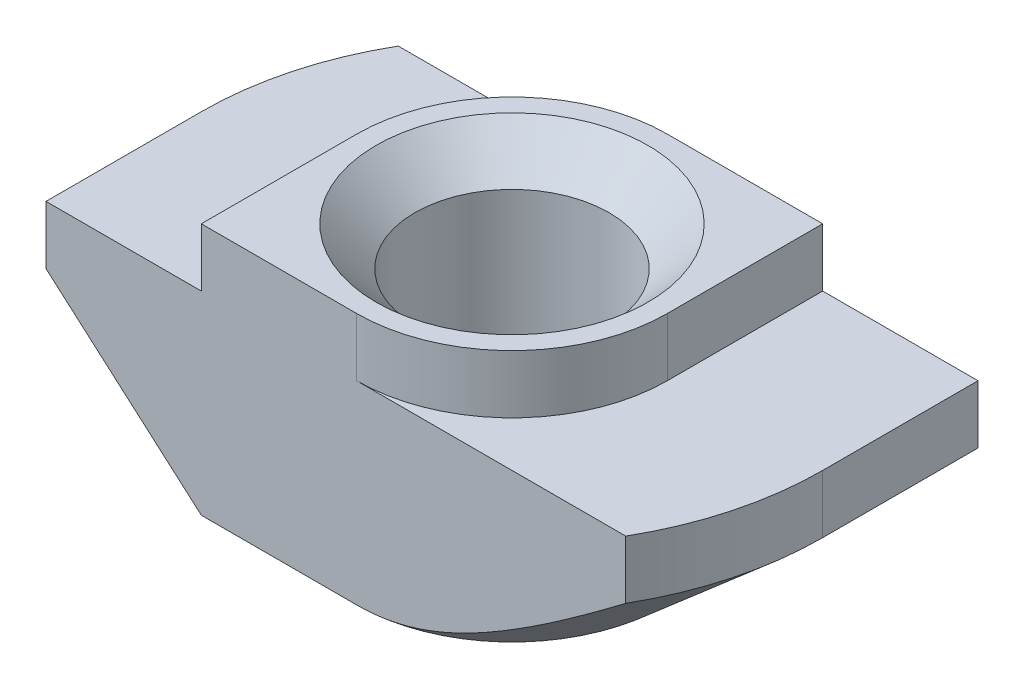
ISO-10303-21;
HEADER;
FILE_DESCRIPTION(('STEP AP214'),'2;1');
FILE_NAME('part.step','',(''),(''),'','','');
FILE_SCHEMA(('AUTOMOTIVE_DESIGN { 1 0 10303 214 1 1 1 1 }'));
ENDSEC;
DATA;
#1=APPLICATION_CONTEXT('core data for automotive mechanical design processes');
#2=APPLICATION_PROTOCOL_DEFINITION('international standard','automotive_design',2000,#1);
#3=PRODUCT_CONTEXT('',#1,'mechanical');
#4=PRODUCT('Part','Part','',(#3));
#5=PRODUCT_RELATED_PRODUCT_CATEGORY('part','',(#4));
#6=PRODUCT_DEFINITION_FORMATION('','',#4);
#7=PRODUCT_DEFINITION_CONTEXT('part definition',#1,'design');
#8=PRODUCT_DEFINITION('design','',#6,#7);
#9=PRODUCT_DEFINITION_SHAPE('','',#8);
#10=(LENGTH_UNIT() NAMED_UNIT(*) SI_UNIT(.MILLI.,.METRE.));
#11=(NAMED_UNIT(*) PLANE_ANGLE_UNIT() SI_UNIT($,.RADIAN.));
#12=(NAMED_UNIT(*) SI_UNIT($,.STERADIAN.) SOLID_ANGLE_UNIT());
#13=UNCERTAINTY_MEASURE_WITH_UNIT(LENGTH_MEASURE(1.E-05),#10,'distance_accuracy_value','');
#14=(GEOMETRIC_REPRESENTATION_CONTEXT(3) GLOBAL_UNCERTAINTY_ASSIGNED_CONTEXT((#13)) GLOBAL_UNIT_ASSIGNED_CONTEXT((#10,
#11,#12)) REPRESENTATION_CONTEXT('',''));
#15=CARTESIAN_POINT('',(0.,0.,0.));
#16=DIRECTION('',(0.,0.,1.));
#17=DIRECTION('',(1.,0.,0.));
#18=AXIS2_PLACEMENT_3D('',#15,#16,#17);
#19=CARTESIAN_POINT('',(-8.,-1.5,4.));
#20=DIRECTION('',(1.,0.,0.));
#21=DIRECTION('',(0.,0.,-1.));
#22=AXIS2_PLACEMENT_3D('',#19,#20,#21);
#23=PLANE('',#22);
#24=DIRECTION('',(0.,0.,-1.));
#25=VECTOR('',#24,1.);
#26=CARTESIAN_POINT('',(-8.,-3.,4.));
#27=LINE('',#26,#25);
#28=CARTESIAN_POINT('',(-8.,-3.,4.));
#29=VERTEX_POINT('',#28);
#30=CARTESIAN_POINT('',(-8.,-3.,0.));
#31=VERTEX_POINT('',#30);
#32=EDGE_CURVE('E316',#29,#31,#27,.T.);
#33=ORIENTED_EDGE('',*,*,#32,.F.);
#34=DIRECTION('',(0.,-1.,0.));
#35=VECTOR('',#34,1.);
#36=CARTESIAN_POINT('',(-8.,-1.5,4.));
#37=LINE('',#36,#35);
#38=CARTESIAN_POINT('',(-8.,-1.5,4.));
#39=VERTEX_POINT('',#38);
#40=EDGE_CURVE('E163',#39,#29,#37,.T.);
#41=ORIENTED_EDGE('',*,*,#40,.F.);
#42=DIRECTION('',(0.,0.,-1.));
#43=VECTOR('',#42,1.);
#44=CARTESIAN_POINT('',(-8.,-1.5,4.));
#45=LINE('',#44,#43);
#46=CARTESIAN_POINT('',(-8.,-1.5,0.));
#47=VERTEX_POINT('',#46);
#48=EDGE_CURVE('E45',#39,#47,#45,.T.);
#49=ORIENTED_EDGE('',*,*,#48,.T.);
#50=DIRECTION('',(0.,1.,0.));
#51=VECTOR('',#50,1.);
#52=CARTESIAN_POINT('',(-8.,-6.5,0.));
#53=LINE('',#52,#51);
#54=EDGE_CURVE('E209',#31,#47,#53,.T.);
#55=ORIENTED_EDGE('',*,*,#54,.F.);
#56=EDGE_LOOP('',(#33,#41,#49,#55));
#57=FACE_BOUND('',#56,.T.);
#58=ADVANCED_FACE('F37',(#57),#23,.F.);
#59=CARTESIAN_POINT('',(-8.,-6.5,4.));
#60=DIRECTION('',(0.,1.,0.));
#61=DIRECTION('',(0.,0.,1.));
#62=AXIS2_PLACEMENT_3D('',#59,#60,#61);
#63=PLANE('',#62);
#64=CARTESIAN_POINT('',(0.,-6.5,0.));
#65=DIRECTION('',(0.,1.,0.));
#66=DIRECTION('',(0.,0.,1.));
#67=AXIS2_PLACEMENT_3D('',#64,#65,#66);
#68=CIRCLE('',#67,3.5);
#69=CARTESIAN_POINT('',(0.,-6.5,3.5));
#70=VERTEX_POINT('',#69);
#71=EDGE_CURVE('E258',#70,#70,#68,.T.);
#72=ORIENTED_EDGE('',*,*,#71,.T.);
#73=EDGE_LOOP('',(#72));
#74=FACE_BOUND('',#73,.T.);
#75=DIRECTION('',(1.,0.,0.));
#76=VECTOR('',#75,1.);
#77=CARTESIAN_POINT('',(-8.,-6.5,4.));
#78=LINE('',#77,#76);
#79=CARTESIAN_POINT('',(-4.,-6.5,4.));
#80=VERTEX_POINT('',#79);
#81=CARTESIAN_POINT('',(0.,-6.5,4.));
#82=VERTEX_POINT('',#81);
#83=EDGE_CURVE('E161',#80,#82,#78,.T.);
#84=ORIENTED_EDGE('',*,*,#83,.F.);
#85=DIRECTION('',(0.,0.,-1.));
#86=VECTOR('',#85,1.);
#87=CARTESIAN_POINT('',(-4.,-6.5,4.));
#88=LINE('',#87,#86);
#89=CARTESIAN_POINT('',(-4.,-6.5,0.));
#90=VERTEX_POINT('',#89);
#91=EDGE_CURVE('E146',#80,#90,#88,.T.);
#92=ORIENTED_EDGE('',*,*,#91,.T.);
#93=CARTESIAN_POINT('',(0.,-6.5,0.));
#94=DIRECTION('',(0.,-1.,0.));
#95=DIRECTION('',(-1.,0.,0.));
#96=AXIS2_PLACEMENT_3D('',#93,#94,#95);
#97=CIRCLE('',#96,4.);
#98=CARTESIAN_POINT('',(0.,-6.5,-4.));
#99=VERTEX_POINT('',#98);
#100=EDGE_CURVE('E317',#90,#99,#97,.T.);
#101=ORIENTED_EDGE('',*,*,#100,.T.);
#102=DIRECTION('',(1.,0.,0.));
#103=VECTOR('',#102,1.);
#104=CARTESIAN_POINT('',(-8.,-6.5,-4.));
#105=LINE('',#104,#103);
#106=CARTESIAN_POINT('',(4.,-6.5,-4.));
#107=VERTEX_POINT('',#106);
#108=EDGE_CURVE('E181',#99,#107,#105,.T.);
#109=ORIENTED_EDGE('',*,*,#108,.T.);
#110=DIRECTION('',(0.,0.,1.));
#111=VECTOR('',#110,1.);
#112=CARTESIAN_POINT('',(4.,-6.5,-8.));
#113=LINE('',#112,#111);
#114=CARTESIAN_POINT('',(4.,-6.5,0.));
#115=VERTEX_POINT('',#114);
#116=EDGE_CURVE('E52',#107,#115,#113,.T.);
#117=ORIENTED_EDGE('',*,*,#116,.T.);
#118=CARTESIAN_POINT('',(0.,-6.5,0.));
#119=DIRECTION('',(0.,-1.,0.));
#120=DIRECTION('',(1.,0.,0.));
#121=AXIS2_PLACEMENT_3D('',#118,#119,#120);
#122=CIRCLE('',#121,4.);
#123=EDGE_CURVE('E167',#115,#82,#122,.T.);
#124=ORIENTED_EDGE('',*,*,#123,.T.);
#125=EDGE_LOOP('',(#84,#92,#101,#109,#117,#124));
#126=FACE_BOUND('',#125,.T.);
#127=ADVANCED_FACE('F166',(#74,#126),#63,.F.);
#128=CARTESIAN_POINT('',(8.,-1.5,4.));
#129=DIRECTION('',(-1.,0.,0.));
#130=DIRECTION('',(0.,0.,1.));
#131=AXIS2_PLACEMENT_3D('',#128,#129,#130);
#132=PLANE('',#131);
#133=DIRECTION('',(0.,0.,1.));
#134=VECTOR('',#133,1.);
#135=CARTESIAN_POINT('',(8.,-3.,-8.));
#136=LINE('',#135,#134);
#137=CARTESIAN_POINT('',(8.,-3.,-4.));
#138=VERTEX_POINT('',#137);
#139=CARTESIAN_POINT('',(8.,-3.,0.));
#140=VERTEX_POINT('',#139);
#141=EDGE_CURVE('E304',#138,#140,#136,.T.);
#142=ORIENTED_EDGE('',*,*,#141,.F.);
#143=DIRECTION('',(0.,1.,0.));
#144=VECTOR('',#143,1.);
#145=CARTESIAN_POINT('',(8.,-1.5,-4.));
#146=LINE('',#145,#144);
#147=CARTESIAN_POINT('',(8.,-1.5,-4.));
#148=VERTEX_POINT('',#147);
#149=EDGE_CURVE('E185',#138,#148,#146,.T.);
#150=ORIENTED_EDGE('',*,*,#149,.T.);
#151=DIRECTION('',(0.,0.,-1.));
#152=VECTOR('',#151,1.);
#153=CARTESIAN_POINT('',(8.,-1.5,4.));
#154=LINE('',#153,#152);
#155=CARTESIAN_POINT('',(8.,-1.5,0.));
#156=VERTEX_POINT('',#155);
#157=EDGE_CURVE('E203',#156,#148,#154,.T.);
#158=ORIENTED_EDGE('',*,*,#157,.F.);
#159=DIRECTION('',(0.,1.,0.));
#160=VECTOR('',#159,1.);
#161=CARTESIAN_POINT('',(8.,-6.5,0.));
#162=LINE('',#161,#160);
#163=EDGE_CURVE('E220',#140,#156,#162,.T.);
#164=ORIENTED_EDGE('',*,*,#163,.F.);
#165=EDGE_LOOP('',(#142,#150,#158,#164));
#166=FACE_BOUND('',#165,.T.);
#167=ADVANCED_FACE('F303',(#166),#132,.F.);
#168=CARTESIAN_POINT('',(0.,0.,4.));
#169=DIRECTION('',(0.,0.,-1.));
#170=DIRECTION('',(-1.,0.,0.));
#171=AXIS2_PLACEMENT_3D('',#168,#169,#170);
#172=PLANE('',#171);
#173=DIRECTION('',(-0.752576694706878,0.658504607868518,0.));
#174=VECTOR('',#173,1.);
#175=CARTESIAN_POINT('',(-4.,-6.5,4.));
#176=LINE('',#175,#174);
#177=EDGE_CURVE('E149',#80,#29,#176,.T.);
#178=ORIENTED_EDGE('',*,*,#177,.F.);
#179=ORIENTED_EDGE('',*,*,#83,.T.);
#180=CARTESIAN_POINT('',(14.6904905784055,3.32215914737832,4.));
#181=CARTESIAN_POINT('',(14.3847340887088,3.06403182750837,4.));
#182=CARTESIAN_POINT('',(14.0787139356754,2.80621594721695,4.));
#183=CARTESIAN_POINT('',(13.4660102927614,2.29136853816874,4.));
#184=CARTESIAN_POINT('',(13.1593267973511,2.03433701599371,4.));
#185=CARTESIAN_POINT('',(12.5450720332835,1.52114597216813,4.));
#186=CARTESIAN_POINT('',(12.2375005226594,1.26498673998448,4.));
#187=CARTESIAN_POINT('',(11.621379785589,0.753848346635908,4.));
#188=CARTESIAN_POINT('',(11.3128305625947,0.498869181312189,4.));
#189=CARTESIAN_POINT('',(10.7002145011881,-0.00491682645367106,4.));
#190=CARTESIAN_POINT('',(10.3961699625989,-0.253750767290044,4.));
#191=CARTESIAN_POINT('',(9.78659827767615,-0.749595514973884,4.));
#192=CARTESIAN_POINT('',(9.48107113722175,-0.996606329041067,4.));
#193=CARTESIAN_POINT('',(8.86814910234505,-1.48822154847088,4.));
#194=CARTESIAN_POINT('',(8.56075445261905,-1.7328262585509,4.));
#195=CARTESIAN_POINT('',(7.94347197423434,-2.21886531838598,4.));
#196=CARTESIAN_POINT('',(7.63358419509566,-2.46029973086189,4.));
#197=CARTESIAN_POINT('',(7.08115132126321,-2.88450105938665,4.));
#198=CARTESIAN_POINT('',(6.83928285358191,-3.06814795081988,4.));
#199=CARTESIAN_POINT('',(6.35294664237881,-3.43201927580775,4.));
#200=CARTESIAN_POINT('',(6.10847869152532,-3.61224343312641,4.));
#201=CARTESIAN_POINT('',(5.61348157153568,-3.97001904061898,4.));
#202=CARTESIAN_POINT('',(5.36291531280204,-4.14751931475903,4.));
#203=CARTESIAN_POINT('',(4.85727365006101,-4.49592911962344,4.));
#204=CARTESIAN_POINT('',(4.60219916319015,-4.66683996887094,4.));
#205=CARTESIAN_POINT('',(4.2130071322017,-4.91734041501033,4.));
#206=CARTESIAN_POINT('',(4.08116535064602,-5.00046374434322,4.));
#207=CARTESIAN_POINT('',(3.81562875478638,-5.16368942812443,4.));
#208=CARTESIAN_POINT('',(3.68193405117562,-5.24379196197976,4.));
#209=CARTESIAN_POINT('',(3.41220147814096,-5.40038499680941,4.));
#210=CARTESIAN_POINT('',(3.27616075326498,-5.47687059912128,4.));
#211=CARTESIAN_POINT('',(3.00156225820197,-5.62520082854102,4.));
#212=CARTESIAN_POINT('',(2.86300454546661,-5.69704556140923,4.));
#213=CARTESIAN_POINT('',(2.5849954677744,-5.83393518990307,4.));
#214=CARTESIAN_POINT('',(2.44558485527697,-5.89906227835382,4.));
#215=CARTESIAN_POINT('',(2.16361562976938,-6.02223140662004,4.));
#216=CARTESIAN_POINT('',(2.02105656760955,-6.08027242774449,4.));
#217=CARTESIAN_POINT('',(1.7329549007792,-6.18735094349871,4.));
#218=CARTESIAN_POINT('',(1.58742049089665,-6.2364102179662,4.));
#219=CARTESIAN_POINT('',(1.29316207972955,-6.32363216278026,4.));
#220=CARTESIAN_POINT('',(1.1444398948231,-6.36180086992272,4.));
#221=CARTESIAN_POINT('',(0.839100640998917,-6.42624492204711,4.));
#222=CARTESIAN_POINT('',(0.682386957719906,-6.45207249805466,4.));
#223=CARTESIAN_POINT('',(0.367144369417336,-6.48794533602483,4.));
#224=CARTESIAN_POINT('',(0.208615728897641,-6.49799286893765,4.));
#225=CARTESIAN_POINT('',(-0.108539722018433,-6.50145944673209,4.));
#226=CARTESIAN_POINT('',(-0.267166425139258,-6.49488795542754,4.));
#227=CARTESIAN_POINT('',(-0.582932728201337,-6.46570204746688,4.));
#228=CARTESIAN_POINT('',(-0.740071943547874,-6.44308359075197,4.));
#229=CARTESIAN_POINT('',(-1.09152696533888,-6.37587755691426,4.));
#230=CARTESIAN_POINT('',(-1.28504118066978,-6.32714329543957,4.));
#231=CARTESIAN_POINT('',(-1.66656634751073,-6.21161586114347,4.));
#232=CARTESIAN_POINT('',(-1.85457361936942,-6.14481090567952,4.));
#233=CARTESIAN_POINT('',(-2.22785278502951,-5.99643229439673,4.));
#234=CARTESIAN_POINT('',(-2.41304095011,-5.91465153583585,4.));
#235=CARTESIAN_POINT('',(-2.77832077795005,-5.74066303773618,4.));
#236=CARTESIAN_POINT('',(-2.95841376958414,-5.64845804888058,4.));
#237=CARTESIAN_POINT('',(-3.34961919306917,-5.43725005686976,4.));
#238=CARTESIAN_POINT('',(-3.55981165080308,-5.31655620274668,4.));
#239=CARTESIAN_POINT('',(-3.97543991863338,-5.06719713259556,4.));
#240=CARTESIAN_POINT('',(-4.18087442666426,-4.93852976912504,4.));
#241=CARTESIAN_POINT('',(-4.5882400284195,-4.67520296890076,4.));
#242=CARTESIAN_POINT('',(-4.79016601988849,-4.54053567979022,4.));
#243=CARTESIAN_POINT('',(-5.19103912814155,-4.26683396442206,4.));
#244=CARTESIAN_POINT('',(-5.38998608598997,-4.12779930637635,4.));
#245=CARTESIAN_POINT('',(-5.7725203673202,-3.8556281179886,4.));
#246=CARTESIAN_POINT('',(-5.95625882060498,-3.72270335637143,4.));
#247=CARTESIAN_POINT('',(-6.32204531106766,-3.45453802790882,4.));
#248=CARTESIAN_POINT('',(-6.50409328688208,-3.31929737750067,4.));
#249=CARTESIAN_POINT('',(-6.86616256077309,-3.04743487184612,4.));
#250=CARTESIAN_POINT('',(-7.04618870734579,-2.91081946202426,4.));
#251=CARTESIAN_POINT('',(-7.4050622812191,-2.63608068651936,4.));
#252=CARTESIAN_POINT('',(-7.58390981061062,-2.49795745427084,4.));
#253=CARTESIAN_POINT('',(-7.76228734813001,-2.35923541653878,4.));
#254=B_SPLINE_CURVE_WITH_KNOTS('',3,(#180,#181,#182,#183,#184,#185,#186,#187,#188,#189,#190,
#191,#192,#193,#194,#195,#196,#197,#198,#199,#200,#201,#202,#203,#204,#205,#206,#207,#208,#209,
#210,#211,#212,#213,#214,#215,#216,#217,#218,#219,#220,#221,#222,#223,#224,#225,#226,#227,#228,
#229,#230,#231,#232,#233,#234,#235,#236,#237,#238,#239,#240,#241,#242,#243,#244,#245,#246,#247,
#248,#249,#250,#251,#252,#253),.UNSPECIFIED.,.F.,.F.,(4,2,2,2,2,2,2,2,2,2,2,2,2,2,2,2,2,2,2,2,2,
2,2,2,2,2,2,2,2,2,2,2,2,2,2,2,4),(0.,1.20043834755379,2.40088674077275,3.60170079974658,
4.8025106235708,5.98117091859529,7.15982654353094,8.33833092623221,9.51681195828205,
10.4278547957749,11.3389708502966,12.2601049438173,13.1810537544666,13.6485968730272,
14.1161121800276,14.5842435321965,15.052364212398,15.5138255838833,15.975353217003,
16.4357464236847,16.8958839298801,17.3716429767656,17.8473335495587,18.3227532981969,
18.798292783222,19.3957954910143,19.9936887317903,20.6005786392438,21.2073087763798,
21.9341934237486,22.6612746952789,23.3893372114805,24.1174384334345,24.7977544137816,
25.4780949934672,26.1560676910982,26.8339808703156),.UNSPECIFIED.);
#255=CARTESIAN_POINT('',(6.92820323027551,-3.,4.));
#256=VERTEX_POINT('',#255);
#257=EDGE_CURVE('E321',#256,#82,#254,.T.);
#258=ORIENTED_EDGE('',*,*,#257,.F.);
#259=DIRECTION('',(0.,1.,0.));
#260=VECTOR('',#259,1.);
#261=CARTESIAN_POINT('',(6.92820323027551,-6.5,4.));
#262=LINE('',#261,#260);
#263=CARTESIAN_POINT('',(6.92820323027551,-1.5,4.));
#264=VERTEX_POINT('',#263);
#265=EDGE_CURVE('E223',#256,#264,#262,.T.);
#266=ORIENTED_EDGE('',*,*,#265,.T.);
#267=DIRECTION('',(-1.,0.,0.));
#268=VECTOR('',#267,1.);
#269=CARTESIAN_POINT('',(4.,-1.5,4.));
#270=LINE('',#269,#268);
#271=CARTESIAN_POINT('',(0.,-1.5,4.));
#272=VERTEX_POINT('',#271);
#273=EDGE_CURVE('E168',#264,#272,#270,.T.);
#274=ORIENTED_EDGE('',*,*,#273,.T.);
#275=DIRECTION('',(0.,1.,0.));
#276=VECTOR('',#275,1.);
#277=CARTESIAN_POINT('',(0.,-7.15685424949238,4.));
#278=LINE('',#277,#276);
#279=CARTESIAN_POINT('',(0.,0.,4.));
#280=VERTEX_POINT('',#279);
#281=EDGE_CURVE('E246',#272,#280,#278,.T.);
#282=ORIENTED_EDGE('',*,*,#281,.T.);
#283=DIRECTION('',(-1.,0.,0.));
#284=VECTOR('',#283,1.);
#285=CARTESIAN_POINT('',(4.,0.,4.));
#286=LINE('',#285,#284);
#287=CARTESIAN_POINT('',(-4.,0.,4.));
#288=VERTEX_POINT('',#287);
#289=EDGE_CURVE('E170',#280,#288,#286,.T.);
#290=ORIENTED_EDGE('',*,*,#289,.T.);
#291=DIRECTION('',(0.,-1.,0.));
#292=VECTOR('',#291,1.);
#293=CARTESIAN_POINT('',(-4.,0.,4.));
#294=LINE('',#293,#292);
#295=CARTESIAN_POINT('',(-4.,-1.5,4.));
#296=VERTEX_POINT('',#295);
#297=EDGE_CURVE('E196',#288,#296,#294,.T.);
#298=ORIENTED_EDGE('',*,*,#297,.T.);
#299=DIRECTION('',(-1.,0.,0.));
#300=VECTOR('',#299,1.);
#301=CARTESIAN_POINT('',(-4.,-1.5,4.));
#302=LINE('',#301,#300);
#303=EDGE_CURVE('E172',#296,#39,#302,.T.);
#304=ORIENTED_EDGE('',*,*,#303,.T.);
#305=ORIENTED_EDGE('',*,*,#40,.T.);
#306=EDGE_LOOP('',(#178,#179,#258,#266,#274,#282,#290,#298,#304,#305));
#307=FACE_BOUND('',#306,.T.);
#308=ADVANCED_FACE('F159',(#307),#172,.F.);
#309=CARTESIAN_POINT('',(0.,0.,-4.));
#310=DIRECTION('',(0.,0.,-1.));
#311=DIRECTION('',(-1.,0.,0.));
#312=AXIS2_PLACEMENT_3D('',#309,#310,#311);
#313=PLANE('',#312);
#314=ORIENTED_EDGE('',*,*,#108,.F.);
#315=CARTESIAN_POINT('',(7.76228734813001,-2.35923541653878,-4.));
#316=CARTESIAN_POINT('',(7.63797879352638,-2.45592015293055,-4.));
#317=CARTESIAN_POINT('',(7.51343705696513,-2.55230486304676,-4.));
#318=CARTESIAN_POINT('',(7.26381762684636,-2.74438155235194,-4.));
#319=CARTESIAN_POINT('',(7.13873992508832,-2.84007352088096,-4.));
#320=CARTESIAN_POINT('',(6.76245796143779,-3.12607801429787,-4.));
#321=CARTESIAN_POINT('',(6.51034969039623,-3.3152061228012,-4.));
#322=CARTESIAN_POINT('',(5.99410259404109,-3.69579382335301,-4.));
#323=CARTESIAN_POINT('',(5.72985208763481,-3.88710225926351,-4.));
#324=CARTESIAN_POINT('',(5.19695761667315,-4.26334385378289,-4.));
#325=CARTESIAN_POINT('',(4.92831530480901,-4.44827933273934,-4.));
#326=CARTESIAN_POINT('',(4.52051944159743,-4.71893396527764,-4.));
#327=CARTESIAN_POINT('',(4.38365763859022,-4.80810405751299,-4.));
#328=CARTESIAN_POINT('',(4.10812140998681,-4.98359259792687,-4.));
#329=CARTESIAN_POINT('',(3.96944707174393,-5.06991118282885,-4.));
#330=CARTESIAN_POINT('',(3.68976495223787,-5.23915159478084,-4.));
#331=CARTESIAN_POINT('',(3.5487541633338,-5.32206847356048,-4.));
#332=CARTESIAN_POINT('',(3.26422692934428,-5.48348784331378,-4.));
#333=CARTESIAN_POINT('',(3.12071056146737,-5.56199046999753,-4.));
#334=CARTESIAN_POINT('',(2.83282374140378,-5.71234353123719,-4.));
#335=CARTESIAN_POINT('',(2.68849544072785,-5.78427356099484,-4.));
#336=CARTESIAN_POINT('',(2.39663673815625,-5.92127244284365,-4.));
#337=CARTESIAN_POINT('',(2.24910576947912,-5.98634006834896,-4.));
#338=CARTESIAN_POINT('',(1.80183158618905,-6.16822752509159,-4.));
#339=CARTESIAN_POINT('',(1.49640789539285,-6.27228099552519,-4.));
#340=CARTESIAN_POINT('',(1.05233061563864,-6.38260096239082,-4.));
#341=CARTESIAN_POINT('',(0.919027463250036,-6.41066102119685,-4.));
#342=CARTESIAN_POINT('',(0.650539921788468,-6.45588615630252,-4.));
#343=CARTESIAN_POINT('',(0.51535553964587,-6.47305127272778,-4.));
#344=CARTESIAN_POINT('',(0.244416454871644,-6.49545105484671,-4.));
#345=CARTESIAN_POINT('',(0.108664879322551,-6.50072304133224,-4.));
#346=CARTESIAN_POINT('',(-0.162768146645618,-6.49911688124239,-4.));
#347=CARTESIAN_POINT('',(-0.298449596114371,-6.49223857411636,-4.));
#348=CARTESIAN_POINT('',(-0.568122439673079,-6.46681378287136,-4.));
#349=CARTESIAN_POINT('',(-0.70211852516428,-6.44831614238918,-4.));
#350=CARTESIAN_POINT('',(-0.968201604754999,-6.40073495061865,-4.));
#351=CARTESIAN_POINT('',(-1.1002884026748,-6.37165031944127,-4.));
#352=CARTESIAN_POINT('',(-1.36269157636567,-6.30410993308005,-4.));
#353=CARTESIAN_POINT('',(-1.49299633565771,-6.2656096419317,-4.));
#354=CARTESIAN_POINT('',(-1.75097360755362,-6.18078638919448,-4.));
#355=CARTESIAN_POINT('',(-1.87864668497093,-6.13446512618272,-4.));
#356=CARTESIAN_POINT('',(-2.13650460655844,-6.03336012265943,-4.));
#357=CARTESIAN_POINT('',(-2.26658470397074,-5.97831141807566,-4.));
#358=CARTESIAN_POINT('',(-2.52419349397128,-5.86250450113516,-4.));
#359=CARTESIAN_POINT('',(-2.65172159663741,-5.80174498673762,-4.));
#360=CARTESIAN_POINT('',(-2.90458369699372,-5.67553363858828,-4.));
#361=CARTESIAN_POINT('',(-3.02991533088425,-5.61007709467075,-4.));
#362=CARTESIAN_POINT('',(-3.27853105159641,-5.47537344560646,-4.));
#363=CARTESIAN_POINT('',(-3.40181492074635,-5.40612594080969,-4.));
#364=CARTESIAN_POINT('',(-3.76995033555259,-5.19320165032188,-4.));
#365=CARTESIAN_POINT('',(-4.01209636597666,-5.04485051553612,-4.));
#366=CARTESIAN_POINT('',(-4.49079845178234,-4.73976449809493,-4.));
#367=CARTESIAN_POINT('',(-4.72735731704249,-4.58303396484722,-4.));
#368=CARTESIAN_POINT('',(-5.1995516100822,-4.26136742283763,-4.));
#369=CARTESIAN_POINT('',(-5.43513045316699,-4.09634866312507,-4.));
#370=CARTESIAN_POINT('',(-5.90307692458374,-3.76178653159456,-4.));
#371=CARTESIAN_POINT('',(-6.13544419976837,-3.59224266810594,-4.));
#372=CARTESIAN_POINT('',(-6.59710196595735,-3.25019721114037,-4.));
#373=CARTESIAN_POINT('',(-6.82639861262667,-3.07770390591183,-4.));
#374=CARTESIAN_POINT('',(-7.28302678091005,-2.73013366535019,-4.));
#375=CARTESIAN_POINT('',(-7.51035827230303,-2.55505669039589,-4.));
#376=CARTESIAN_POINT('',(-8.03783315756055,-2.14507175665098,-4.));
#377=CARTESIAN_POINT('',(-8.3373766439722,-1.9093927266408,-4.));
#378=CARTESIAN_POINT('',(-8.93437099912731,-1.43539503283533,-4.));
#379=CARTESIAN_POINT('',(-9.23182183438345,-1.19707632695543,-4.));
#380=CARTESIAN_POINT('',(-9.82535128846929,-0.718219965327653,-4.));
#381=CARTESIAN_POINT('',(-10.1214285131884,-0.477680583301082,-4.));
#382=CARTESIAN_POINT('',(-10.7122981245554,0.00497082797734213,-4.));
#383=CARTESIAN_POINT('',(-11.0070905087482,0.247082860232109,-4.));
#384=CARTESIAN_POINT('',(-11.5854434366838,0.724142336197048,-4.));
#385=CARTESIAN_POINT('',(-11.8690391078616,0.959047220790179,-4.));
#386=CARTESIAN_POINT('',(-12.4354432527144,1.42980508271359,-4.));
#387=CARTESIAN_POINT('',(-12.7182517245472,1.66565806225948,-4.));
#388=CARTESIAN_POINT('',(-13.282944518856,2.13791575666086,-4.));
#389=CARTESIAN_POINT('',(-13.5648294691391,2.37431972115667,-4.));
#390=CARTESIAN_POINT('',(-14.128047944097,2.84778043170314,-4.));
#391=CARTESIAN_POINT('',(-14.4093814719245,3.08483717400299,-4.));
#392=CARTESIAN_POINT('',(-14.6904905784055,3.32215914737832,-4.));
#393=B_SPLINE_CURVE_WITH_KNOTS('',3,(#315,#316,#317,#318,#319,#320,#321,#322,#323,#324,#325,
#326,#327,#328,#329,#330,#331,#332,#333,#334,#335,#336,#337,#338,#339,#340,#341,#342,#343,#344,
#345,#346,#347,#348,#349,#350,#351,#352,#353,#354,#355,#356,#357,#358,#359,#360,#361,#362,#363,
#364,#365,#366,#367,#368,#369,#370,#371,#372,#373,#374,#375,#376,#377,#378,#379,#380,#381,#382,
#383,#384,#385,#386,#387,#388,#389,#390,#391,#392),.UNSPECIFIED.,.F.,.F.,(4,2,2,2,2,2,2,2,2,2,2,
2,2,2,2,2,2,2,2,2,2,2,2,2,2,2,2,2,2,2,2,2,2,2,2,2,2,2,4),(0.,0.472444676861442,
0.944896608343604,1.89035158415088,2.86899060339188,3.84726945941377,4.33728530856671,
4.8272776283419,5.31795911845949,5.8086255149935,6.29221715677115,6.7758950897278,
7.73984294601889,8.14815209258924,8.55645973536539,8.96348431070383,9.37051426439336,
9.77584455197681,10.1812161954516,10.5885436411454,10.9957827360295,11.4193610225933,
11.8430361185904,12.2671421774613,12.6912930327904,13.5429259149977,14.3941209613749,
15.25692369152,16.1198205533784,16.9805978250682,17.8413883107243,18.9847995557902,
20.1282290566799,21.2726382692414,22.4170496676496,23.5217921033681,24.6265371222737,
25.7302179249054,26.8338923990378),.UNSPECIFIED.);
#394=CARTESIAN_POINT('',(-6.92820323027551,-3.,-4.));
#395=VERTEX_POINT('',#394);
#396=EDGE_CURVE('E227',#99,#395,#393,.T.);
#397=ORIENTED_EDGE('',*,*,#396,.T.);
#398=DIRECTION('',(0.,1.,0.));
#399=VECTOR('',#398,1.);
#400=CARTESIAN_POINT('',(-6.92820323027551,-6.5,-4.));
#401=LINE('',#400,#399);
#402=CARTESIAN_POINT('',(-6.92820323027551,-1.5,-4.));
#403=VERTEX_POINT('',#402);
#404=EDGE_CURVE('E219',#395,#403,#401,.T.);
#405=ORIENTED_EDGE('',*,*,#404,.T.);
#406=DIRECTION('',(-1.,0.,0.));
#407=VECTOR('',#406,1.);
#408=CARTESIAN_POINT('',(-4.,-1.5,-4.));
#409=LINE('',#408,#407);
#410=CARTESIAN_POINT('',(0.,-1.5,-4.));
#411=VERTEX_POINT('',#410);
#412=EDGE_CURVE('E178',#411,#403,#409,.T.);
#413=ORIENTED_EDGE('',*,*,#412,.F.);
#414=DIRECTION('',(0.,1.,0.));
#415=VECTOR('',#414,1.);
#416=CARTESIAN_POINT('',(0.,-7.15685424949238,-4.));
#417=LINE('',#416,#415);
#418=CARTESIAN_POINT('',(0.,0.,-4.));
#419=VERTEX_POINT('',#418);
#420=EDGE_CURVE('E255',#411,#419,#417,.T.);
#421=ORIENTED_EDGE('',*,*,#420,.T.);
#422=DIRECTION('',(-1.,0.,0.));
#423=VECTOR('',#422,1.);
#424=CARTESIAN_POINT('',(4.,0.,-4.));
#425=LINE('',#424,#423);
#426=CARTESIAN_POINT('',(4.,0.,-4.));
#427=VERTEX_POINT('',#426);
#428=EDGE_CURVE('E193',#427,#419,#425,.T.);
#429=ORIENTED_EDGE('',*,*,#428,.F.);
#430=DIRECTION('',(0.,1.,0.));
#431=VECTOR('',#430,1.);
#432=CARTESIAN_POINT('',(4.,0.,-4.));
#433=LINE('',#432,#431);
#434=CARTESIAN_POINT('',(4.,-1.5,-4.));
#435=VERTEX_POINT('',#434);
#436=EDGE_CURVE('E190',#435,#427,#433,.T.);
#437=ORIENTED_EDGE('',*,*,#436,.F.);
#438=DIRECTION('',(-1.,0.,0.));
#439=VECTOR('',#438,1.);
#440=CARTESIAN_POINT('',(4.,-1.5,-4.));
#441=LINE('',#440,#439);
#442=EDGE_CURVE('E187',#148,#435,#441,.T.);
#443=ORIENTED_EDGE('',*,*,#442,.F.);
#444=ORIENTED_EDGE('',*,*,#149,.F.);
#445=DIRECTION('',(-0.752576694706878,-0.658504607868518,0.));
#446=VECTOR('',#445,1.);
#447=CARTESIAN_POINT('',(4.95575221238938,-5.66371681415929,-4.));
#448=LINE('',#447,#446);
#449=EDGE_CURVE('E313',#138,#107,#448,.T.);
#450=ORIENTED_EDGE('',*,*,#449,.T.);
#451=EDGE_LOOP('',(#314,#397,#405,#413,#421,#429,#437,#443,#444,#450));
#452=FACE_BOUND('',#451,.T.);
#453=ADVANCED_FACE('F283',(#452),#313,.T.);
#454=CARTESIAN_POINT('',(0.,-6.5,0.));
#455=DIRECTION('',(0.,1.,0.));
#456=DIRECTION('',(-1.,0.,0.));
#457=AXIS2_PLACEMENT_3D('',#454,#455,#456);
#458=CYLINDRICAL_SURFACE('',#457,8.);
#459=CARTESIAN_POINT('',(0.,-3.,0.));
#460=DIRECTION('',(0.,-1.,0.));
#461=DIRECTION('',(-1.,0.,0.));
#462=AXIS2_PLACEMENT_3D('',#459,#460,#461);
#463=CIRCLE('',#462,8.);
#464=EDGE_CURVE('E60',#31,#395,#463,.T.);
#465=ORIENTED_EDGE('',*,*,#464,.F.);
#466=ORIENTED_EDGE('',*,*,#54,.T.);
#467=CARTESIAN_POINT('',(0.,-1.5,0.));
#468=DIRECTION('',(0.,-1.,0.));
#469=DIRECTION('',(-1.,0.,0.));
#470=AXIS2_PLACEMENT_3D('',#467,#468,#469);
#471=CIRCLE('',#470,8.);
#472=EDGE_CURVE('E215',#47,#403,#471,.T.);
#473=ORIENTED_EDGE('',*,*,#472,.T.);
#474=ORIENTED_EDGE('',*,*,#404,.F.);
#475=EDGE_LOOP('',(#465,#466,#473,#474));
#476=FACE_BOUND('',#475,.T.);
#477=ADVANCED_FACE('F344',(#476),#458,.T.);
#478=CARTESIAN_POINT('',(0.,-6.5,0.));
#479=DIRECTION('',(0.,1.,0.));
#480=DIRECTION('',(-1.,0.,0.));
#481=AXIS2_PLACEMENT_3D('',#478,#479,#480);
#482=CYLINDRICAL_SURFACE('',#481,8.);
#483=CARTESIAN_POINT('',(0.,-3.,0.));
#484=DIRECTION('',(0.,-1.,0.));
#485=DIRECTION('',(1.,0.,0.));
#486=AXIS2_PLACEMENT_3D('',#483,#484,#485);
#487=CIRCLE('',#486,8.);
#488=EDGE_CURVE('E309',#140,#256,#487,.T.);
#489=ORIENTED_EDGE('',*,*,#488,.F.);
#490=ORIENTED_EDGE('',*,*,#163,.T.);
#491=CARTESIAN_POINT('',(0.,-1.5,0.));
#492=DIRECTION('',(0.,-1.,0.));
#493=DIRECTION('',(1.,0.,0.));
#494=AXIS2_PLACEMENT_3D('',#491,#492,#493);
#495=CIRCLE('',#494,8.);
#496=EDGE_CURVE('E237',#156,#264,#495,.T.);
#497=ORIENTED_EDGE('',*,*,#496,.T.);
#498=ORIENTED_EDGE('',*,*,#265,.F.);
#499=EDGE_LOOP('',(#489,#490,#497,#498));
#500=FACE_BOUND('',#499,.T.);
#501=ADVANCED_FACE('F347',(#500),#482,.T.);
#502=CARTESIAN_POINT('',(-4.,0.,4.));
#503=DIRECTION('',(1.,0.,0.));
#504=DIRECTION('',(0.,0.,-1.));
#505=AXIS2_PLACEMENT_3D('',#502,#503,#504);
#506=PLANE('',#505);
#507=DIRECTION('',(0.,0.,-1.));
#508=VECTOR('',#507,1.);
#509=CARTESIAN_POINT('',(-4.,0.,4.));
#510=LINE('',#509,#508);
#511=CARTESIAN_POINT('',(-4.,0.,0.));
#512=VERTEX_POINT('',#511);
#513=EDGE_CURVE('E177',#288,#512,#510,.T.);
#514=ORIENTED_EDGE('',*,*,#513,.T.);
#515=DIRECTION('',(0.,1.,0.));
#516=VECTOR('',#515,1.);
#517=CARTESIAN_POINT('',(-4.,-7.15685424949238,0.));
#518=LINE('',#517,#516);
#519=CARTESIAN_POINT('',(-4.,-1.5,0.));
#520=VERTEX_POINT('',#519);
#521=EDGE_CURVE('E252',#520,#512,#518,.T.);
#522=ORIENTED_EDGE('',*,*,#521,.F.);
#523=DIRECTION('',(0.,0.,-1.));
#524=VECTOR('',#523,1.);
#525=CARTESIAN_POINT('',(-4.,-1.5,4.));
#526=LINE('',#525,#524);
#527=EDGE_CURVE('E11',#296,#520,#526,.T.);
#528=ORIENTED_EDGE('',*,*,#527,.F.);
#529=ORIENTED_EDGE('',*,*,#297,.F.);
#530=EDGE_LOOP('',(#514,#522,#528,#529));
#531=FACE_BOUND('',#530,.T.);
#532=ADVANCED_FACE('F39',(#531),#506,.F.);
#533=CARTESIAN_POINT('',(-4.,-1.5,4.));
#534=DIRECTION('',(0.,-1.,0.));
#535=DIRECTION('',(1.,0.,0.));
#536=AXIS2_PLACEMENT_3D('',#533,#534,#535);
#537=PLANE('',#536);
#538=ORIENTED_EDGE('',*,*,#412,.T.);
#539=ORIENTED_EDGE('',*,*,#472,.F.);
#540=ORIENTED_EDGE('',*,*,#48,.F.);
#541=ORIENTED_EDGE('',*,*,#303,.F.);
#542=ORIENTED_EDGE('',*,*,#527,.T.);
#543=CARTESIAN_POINT('',(0.,-1.5,0.));
#544=DIRECTION('',(0.,-1.,0.));
#545=DIRECTION('',(1.,0.,0.));
#546=AXIS2_PLACEMENT_3D('',#543,#544,#545);
#547=CIRCLE('',#546,4.);
#548=EDGE_CURVE('E253',#520,#411,#547,.T.);
#549=ORIENTED_EDGE('',*,*,#548,.T.);
#550=EDGE_LOOP('',(#538,#539,#540,#541,#542,#549));
#551=FACE_BOUND('',#550,.T.);
#552=ADVANCED_FACE('F212',(#551),#537,.F.);
#553=CARTESIAN_POINT('',(4.,-1.5,4.));
#554=DIRECTION('',(0.,-1.,0.));
#555=DIRECTION('',(1.,0.,0.));
#556=AXIS2_PLACEMENT_3D('',#553,#554,#555);
#557=PLANE('',#556);
#558=ORIENTED_EDGE('',*,*,#273,.F.);
#559=ORIENTED_EDGE('',*,*,#496,.F.);
#560=ORIENTED_EDGE('',*,*,#157,.T.);
#561=ORIENTED_EDGE('',*,*,#442,.T.);
#562=DIRECTION('',(0.,0.,-1.));
#563=VECTOR('',#562,1.);
#564=CARTESIAN_POINT('',(4.,-1.5,4.));
#565=LINE('',#564,#563);
#566=CARTESIAN_POINT('',(4.,-1.5,0.));
#567=VERTEX_POINT('',#566);
#568=EDGE_CURVE('E201',#567,#435,#565,.T.);
#569=ORIENTED_EDGE('',*,*,#568,.F.);
#570=CARTESIAN_POINT('',(0.,-1.5,0.));
#571=DIRECTION('',(0.,-1.,0.));
#572=DIRECTION('',(1.,0.,0.));
#573=AXIS2_PLACEMENT_3D('',#570,#571,#572);
#574=CIRCLE('',#573,4.);
#575=EDGE_CURVE('E243',#567,#272,#574,.T.);
#576=ORIENTED_EDGE('',*,*,#575,.T.);
#577=EDGE_LOOP('',(#558,#559,#560,#561,#569,#576));
#578=FACE_BOUND('',#577,.T.);
#579=ADVANCED_FACE('F297',(#578),#557,.F.);
#580=CARTESIAN_POINT('',(4.,0.,4.));
#581=DIRECTION('',(-1.,0.,0.));
#582=DIRECTION('',(0.,0.,1.));
#583=AXIS2_PLACEMENT_3D('',#580,#581,#582);
#584=PLANE('',#583);
#585=DIRECTION('',(0.,0.,-1.));
#586=VECTOR('',#585,1.);
#587=CARTESIAN_POINT('',(4.,0.,4.));
#588=LINE('',#587,#586);
#589=CARTESIAN_POINT('',(4.,0.,0.));
#590=VERTEX_POINT('',#589);
#591=EDGE_CURVE('E199',#590,#427,#588,.T.);
#592=ORIENTED_EDGE('',*,*,#591,.F.);
#593=DIRECTION('',(0.,1.,0.));
#594=VECTOR('',#593,1.);
#595=CARTESIAN_POINT('',(4.,-7.15685424949238,0.));
#596=LINE('',#595,#594);
#597=EDGE_CURVE('E242',#567,#590,#596,.T.);
#598=ORIENTED_EDGE('',*,*,#597,.F.);
#599=ORIENTED_EDGE('',*,*,#568,.T.);
#600=ORIENTED_EDGE('',*,*,#436,.T.);
#601=EDGE_LOOP('',(#592,#598,#599,#600));
#602=FACE_BOUND('',#601,.T.);
#603=ADVANCED_FACE('F291',(#602),#584,.F.);
#604=CARTESIAN_POINT('',(4.,0.,4.));
#605=DIRECTION('',(0.,-1.,0.));
#606=DIRECTION('',(0.,0.,-1.));
#607=AXIS2_PLACEMENT_3D('',#604,#605,#606);
#608=PLANE('',#607);
#609=CARTESIAN_POINT('',(0.,0.,0.));
#610=DIRECTION('',(0.,1.,0.));
#611=DIRECTION('',(0.,0.,1.));
#612=AXIS2_PLACEMENT_3D('',#609,#610,#611);
#613=CIRCLE('',#612,3.5);
#614=CARTESIAN_POINT('',(0.,0.,3.5));
#615=VERTEX_POINT('',#614);
#616=EDGE_CURVE('E262',#615,#615,#613,.T.);
#617=ORIENTED_EDGE('',*,*,#616,.F.);
#618=EDGE_LOOP('',(#617));
#619=FACE_BOUND('',#618,.T.);
#620=ORIENTED_EDGE('',*,*,#289,.F.);
#621=CARTESIAN_POINT('',(0.,0.,0.));
#622=DIRECTION('',(0.,-1.,0.));
#623=DIRECTION('',(0.,0.,-1.));
#624=AXIS2_PLACEMENT_3D('',#621,#622,#623);
#625=CIRCLE('',#624,4.);
#626=EDGE_CURVE('E235',#590,#280,#625,.T.);
#627=ORIENTED_EDGE('',*,*,#626,.F.);
#628=ORIENTED_EDGE('',*,*,#591,.T.);
#629=ORIENTED_EDGE('',*,*,#428,.T.);
#630=CARTESIAN_POINT('',(0.,0.,0.));
#631=DIRECTION('',(0.,-1.,0.));
#632=DIRECTION('',(0.,0.,-1.));
#633=AXIS2_PLACEMENT_3D('',#630,#631,#632);
#634=CIRCLE('',#633,4.);
#635=EDGE_CURVE('E250',#512,#419,#634,.T.);
#636=ORIENTED_EDGE('',*,*,#635,.F.);
#637=ORIENTED_EDGE('',*,*,#513,.F.);
#638=EDGE_LOOP('',(#620,#627,#628,#629,#636,#637));
#639=FACE_BOUND('',#638,.T.);
#640=ADVANCED_FACE('F286',(#619,#639),#608,.F.);
#641=CARTESIAN_POINT('',(0.,-5.5,0.));
#642=DIRECTION('',(0.,-1.,0.));
#643=DIRECTION('',(0.,0.,-1.));
#644=AXIS2_PLACEMENT_3D('',#641,#642,#643);
#645=CONICAL_SURFACE('',#644,2.5,0.785398163397447);
#646=ORIENTED_EDGE('',*,*,#71,.F.);
#647=EDGE_LOOP('',(#646));
#648=FACE_BOUND('',#647,.T.);
#649=CARTESIAN_POINT('',(0.,-5.5,0.));
#650=DIRECTION('',(0.,1.,0.));
#651=DIRECTION('',(0.,0.,1.));
#652=AXIS2_PLACEMENT_3D('',#649,#650,#651);
#653=CIRCLE('',#652,2.5);
#654=CARTESIAN_POINT('',(0.,-5.5,2.5));
#655=VERTEX_POINT('',#654);
#656=EDGE_CURVE('E182',#655,#655,#653,.T.);
#657=ORIENTED_EDGE('',*,*,#656,.T.);
#658=EDGE_LOOP('',(#657));
#659=FACE_BOUND('',#658,.T.);
#660=ADVANCED_FACE('F362',(#648,#659),#645,.F.);
#661=CARTESIAN_POINT('',(0.,0.,0.));
#662=DIRECTION('',(0.,1.,0.));
#663=DIRECTION('',(0.,0.,1.));
#664=AXIS2_PLACEMENT_3D('',#661,#662,#663);
#665=CYLINDRICAL_SURFACE('',#664,2.5);
#666=ORIENTED_EDGE('',*,*,#656,.F.);
#667=EDGE_LOOP('',(#666));
#668=FACE_BOUND('',#667,.T.);
#669=CARTESIAN_POINT('',(0.,-0.999999999999999,0.));
#670=DIRECTION('',(0.,1.,0.));
#671=DIRECTION('',(0.,0.,1.));
#672=AXIS2_PLACEMENT_3D('',#669,#670,#671);
#673=CIRCLE('',#672,2.5);
#674=CARTESIAN_POINT('',(0.,-0.999999999999999,2.5));
#675=VERTEX_POINT('',#674);
#676=EDGE_CURVE('E265',#675,#675,#673,.T.);
#677=ORIENTED_EDGE('',*,*,#676,.T.);
#678=EDGE_LOOP('',(#677));
#679=FACE_BOUND('',#678,.T.);
#680=ADVANCED_FACE('F359',(#668,#679),#665,.F.);
#681=CARTESIAN_POINT('',(0.,0.,0.));
#682=DIRECTION('',(0.,1.,0.));
#683=DIRECTION('',(0.,0.,1.));
#684=AXIS2_PLACEMENT_3D('',#681,#682,#683);
#685=CONICAL_SURFACE('',#684,3.5,0.785398163397449);
#686=ORIENTED_EDGE('',*,*,#676,.F.);
#687=EDGE_LOOP('',(#686));
#688=FACE_BOUND('',#687,.T.);
#689=ORIENTED_EDGE('',*,*,#616,.T.);
#690=EDGE_LOOP('',(#689));
#691=FACE_BOUND('',#690,.T.);
#692=ADVANCED_FACE('F356',(#688,#691),#685,.F.);
#693=CARTESIAN_POINT('',(0.,-7.15685424949238,0.));
#694=DIRECTION('',(0.,1.,0.));
#695=DIRECTION('',(0.,0.,1.));
#696=AXIS2_PLACEMENT_3D('',#693,#694,#695);
#697=CYLINDRICAL_SURFACE('',#696,4.);
#698=ORIENTED_EDGE('',*,*,#521,.T.);
#699=ORIENTED_EDGE('',*,*,#635,.T.);
#700=ORIENTED_EDGE('',*,*,#420,.F.);
#701=ORIENTED_EDGE('',*,*,#548,.F.);
#702=EDGE_LOOP('',(#698,#699,#700,#701));
#703=FACE_BOUND('',#702,.T.);
#704=ADVANCED_FACE('F278',(#703),#697,.T.);
#705=CARTESIAN_POINT('',(0.,-7.15685424949238,0.));
#706=DIRECTION('',(0.,1.,0.));
#707=DIRECTION('',(0.,0.,1.));
#708=AXIS2_PLACEMENT_3D('',#705,#706,#707);
#709=CYLINDRICAL_SURFACE('',#708,4.);
#710=ORIENTED_EDGE('',*,*,#597,.T.);
#711=ORIENTED_EDGE('',*,*,#626,.T.);
#712=ORIENTED_EDGE('',*,*,#281,.F.);
#713=ORIENTED_EDGE('',*,*,#575,.F.);
#714=EDGE_LOOP('',(#710,#711,#712,#713));
#715=FACE_BOUND('',#714,.T.);
#716=ADVANCED_FACE('F339',(#715),#709,.T.);
#717=CARTESIAN_POINT('',(4.,-6.5,-8.));
#718=DIRECTION('',(0.658504607868518,-0.752576694706878,0.));
#719=DIRECTION('',(0.752576694706878,0.658504607868518,0.));
#720=AXIS2_PLACEMENT_3D('',#717,#718,#719);
#721=PLANE('',#720);
#722=ORIENTED_EDGE('',*,*,#141,.T.);
#723=DIRECTION('',(0.752576694706878,0.658504607868518,0.));
#724=VECTOR('',#723,1.);
#725=CARTESIAN_POINT('',(4.,-6.5,0.));
#726=LINE('',#725,#724);
#727=EDGE_CURVE('E306',#115,#140,#726,.T.);
#728=ORIENTED_EDGE('',*,*,#727,.F.);
#729=ORIENTED_EDGE('',*,*,#116,.F.);
#730=ORIENTED_EDGE('',*,*,#449,.F.);
#731=EDGE_LOOP('',(#722,#728,#729,#730));
#732=FACE_BOUND('',#731,.T.);
#733=ADVANCED_FACE('F334',(#732),#721,.T.);
#734=CARTESIAN_POINT('',(0.,-6.5,0.));
#735=DIRECTION('',(0.,1.,0.));
#736=DIRECTION('',(0.,0.,1.));
#737=AXIS2_PLACEMENT_3D('',#734,#735,#736);
#738=CONICAL_SURFACE('',#737,4.,0.851966327173272);
#739=ORIENTED_EDGE('',*,*,#257,.T.);
#740=ORIENTED_EDGE('',*,*,#123,.F.);
#741=ORIENTED_EDGE('',*,*,#727,.T.);
#742=ORIENTED_EDGE('',*,*,#488,.T.);
#743=EDGE_LOOP('',(#739,#740,#741,#742));
#744=FACE_BOUND('',#743,.T.);
#745=ADVANCED_FACE('F330',(#744),#738,.T.);
#746=CARTESIAN_POINT('',(-4.,-6.5,4.));
#747=DIRECTION('',(-0.658504607868518,-0.752576694706878,0.));
#748=DIRECTION('',(0.752576694706878,-0.658504607868518,0.));
#749=AXIS2_PLACEMENT_3D('',#746,#747,#748);
#750=PLANE('',#749);
#751=ORIENTED_EDGE('',*,*,#32,.T.);
#752=DIRECTION('',(-0.752576694706878,0.658504607868518,0.));
#753=VECTOR('',#752,1.);
#754=CARTESIAN_POINT('',(-4.,-6.5,0.));
#755=LINE('',#754,#753);
#756=EDGE_CURVE('E151',#90,#31,#755,.T.);
#757=ORIENTED_EDGE('',*,*,#756,.F.);
#758=ORIENTED_EDGE('',*,*,#91,.F.);
#759=ORIENTED_EDGE('',*,*,#177,.T.);
#760=EDGE_LOOP('',(#751,#757,#758,#759));
#761=FACE_BOUND('',#760,.T.);
#762=ADVANCED_FACE('F148',(#761),#750,.T.);
#763=CARTESIAN_POINT('',(0.,-6.5,0.));
#764=DIRECTION('',(0.,1.,0.));
#765=DIRECTION('',(0.,0.,1.));
#766=AXIS2_PLACEMENT_3D('',#763,#764,#765);
#767=CONICAL_SURFACE('',#766,4.,0.851966327173272);
#768=ORIENTED_EDGE('',*,*,#100,.F.);
#769=ORIENTED_EDGE('',*,*,#756,.T.);
#770=ORIENTED_EDGE('',*,*,#464,.T.);
#771=ORIENTED_EDGE('',*,*,#396,.F.);
#772=EDGE_LOOP('',(#768,#769,#770,#771));
#773=FACE_BOUND('',#772,.T.);
#774=ADVANCED_FACE('F336',(#773),#767,.T.);
#775=CLOSED_SHELL('',(#58,#127,#167,#308,#453,#477,#501,#532,#552,#579,#603,#640,#660,#680,#692,
#704,#716,#733,#745,#762,#774));
#776=MANIFOLD_SOLID_BREP('B2',#775);
#777=ADVANCED_BREP_SHAPE_REPRESENTATION('',(#18,#776),#14);
#778=SHAPE_DEFINITION_REPRESENTATION(#9,#777);
ENDSEC;
END-ISO-10303-21;
